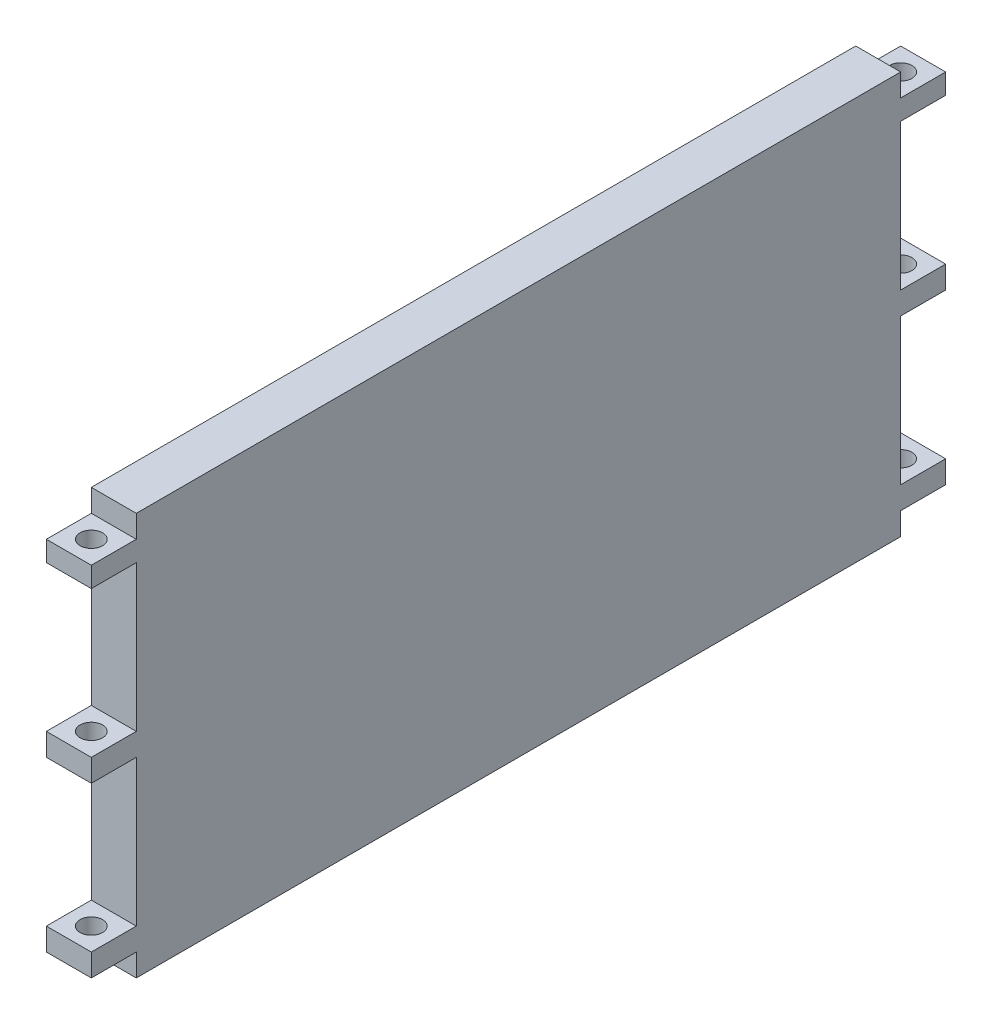
ISO-10303-21;
HEADER;
FILE_DESCRIPTION(('STEP AP214'),'2;1');
FILE_NAME('part.step','',(''),(''),'','','');
FILE_SCHEMA(('AUTOMOTIVE_DESIGN { 1 0 10303 214 1 1 1 1 }'));
ENDSEC;
DATA;
#1=APPLICATION_CONTEXT('core data for automotive mechanical design processes');
#2=APPLICATION_PROTOCOL_DEFINITION('international standard','automotive_design',2000,#1);
#3=PRODUCT_CONTEXT('',#1,'mechanical');
#4=PRODUCT('Part','Part','',(#3));
#5=PRODUCT_RELATED_PRODUCT_CATEGORY('part','',(#4));
#6=PRODUCT_DEFINITION_FORMATION('','',#4);
#7=PRODUCT_DEFINITION_CONTEXT('part definition',#1,'design');
#8=PRODUCT_DEFINITION('design','',#6,#7);
#9=PRODUCT_DEFINITION_SHAPE('','',#8);
#10=(LENGTH_UNIT() NAMED_UNIT(*) SI_UNIT(.MILLI.,.METRE.));
#11=(NAMED_UNIT(*) PLANE_ANGLE_UNIT() SI_UNIT($,.RADIAN.));
#12=(NAMED_UNIT(*) SI_UNIT($,.STERADIAN.) SOLID_ANGLE_UNIT());
#13=UNCERTAINTY_MEASURE_WITH_UNIT(LENGTH_MEASURE(1.E-05),#10,'distance_accuracy_value','');
#14=(GEOMETRIC_REPRESENTATION_CONTEXT(3) GLOBAL_UNCERTAINTY_ASSIGNED_CONTEXT((#13)) GLOBAL_UNIT_ASSIGNED_CONTEXT((#10,
#11,#12)) REPRESENTATION_CONTEXT('',''));
#15=CARTESIAN_POINT('',(0.,0.,0.));
#16=DIRECTION('',(0.,0.,1.));
#17=DIRECTION('',(1.,0.,0.));
#18=AXIS2_PLACEMENT_3D('',#15,#16,#17);
#19=CARTESIAN_POINT('',(20.,89.5,190.));
#20=DIRECTION('',(0.,-1.,0.));
#21=DIRECTION('',(0.,0.,-1.));
#22=AXIS2_PLACEMENT_3D('',#19,#20,#21);
#23=PLANE('',#22);
#24=DIRECTION('',(-1.,0.,0.));
#25=VECTOR('',#24,1.);
#26=CARTESIAN_POINT('',(0.,89.5,-170.));
#27=LINE('',#26,#25);
#28=CARTESIAN_POINT('',(20.,89.5,-170.));
#29=VERTEX_POINT('',#28);
#30=CARTESIAN_POINT('',(0.,89.5,-170.));
#31=VERTEX_POINT('',#30);
#32=EDGE_CURVE('E267',#29,#31,#27,.T.);
#33=ORIENTED_EDGE('',*,*,#32,.T.);
#34=DIRECTION('',(0.,0.,1.));
#35=VECTOR('',#34,1.);
#36=CARTESIAN_POINT('',(0.,89.5,190.));
#37=LINE('',#36,#35);
#38=CARTESIAN_POINT('',(0.,89.5,170.));
#39=VERTEX_POINT('',#38);
#40=EDGE_CURVE('E507',#31,#39,#37,.T.);
#41=ORIENTED_EDGE('',*,*,#40,.T.);
#42=DIRECTION('',(-1.,0.,0.));
#43=VECTOR('',#42,1.);
#44=CARTESIAN_POINT('',(0.,89.5,170.));
#45=LINE('',#44,#43);
#46=CARTESIAN_POINT('',(20.,89.5,170.));
#47=VERTEX_POINT('',#46);
#48=EDGE_CURVE('E420',#47,#39,#45,.T.);
#49=ORIENTED_EDGE('',*,*,#48,.F.);
#50=DIRECTION('',(0.,0.,1.));
#51=VECTOR('',#50,1.);
#52=CARTESIAN_POINT('',(20.,89.5,190.));
#53=LINE('',#52,#51);
#54=EDGE_CURVE('E495',#29,#47,#53,.T.);
#55=ORIENTED_EDGE('',*,*,#54,.F.);
#56=EDGE_LOOP('',(#33,#41,#49,#55));
#57=FACE_BOUND('',#56,.T.);
#58=ADVANCED_FACE('F40',(#57),#23,.F.);
#59=CARTESIAN_POINT('',(20.,89.5,-190.));
#60=DIRECTION('',(0.,0.,1.));
#61=DIRECTION('',(0.,-1.,0.));
#62=AXIS2_PLACEMENT_3D('',#59,#60,#61);
#63=PLANE('',#62);
#64=DIRECTION('',(1.,0.,0.));
#65=VECTOR('',#64,1.);
#66=CARTESIAN_POINT('',(0.,79.5,-190.));
#67=LINE('',#66,#65);
#68=CARTESIAN_POINT('',(0.,79.5,-190.));
#69=VERTEX_POINT('',#68);
#70=CARTESIAN_POINT('',(20.,79.5,-190.));
#71=VERTEX_POINT('',#70);
#72=EDGE_CURVE('E268',#69,#71,#67,.T.);
#73=ORIENTED_EDGE('',*,*,#72,.T.);
#74=DIRECTION('',(0.,1.,0.));
#75=VECTOR('',#74,1.);
#76=CARTESIAN_POINT('',(20.,89.5,-190.));
#77=LINE('',#76,#75);
#78=CARTESIAN_POINT('',(20.,70.5,-190.));
#79=VERTEX_POINT('',#78);
#80=EDGE_CURVE('E489',#79,#71,#77,.T.);
#81=ORIENTED_EDGE('',*,*,#80,.F.);
#82=DIRECTION('',(-1.,0.,0.));
#83=VECTOR('',#82,1.);
#84=CARTESIAN_POINT('',(0.,70.5,-190.));
#85=LINE('',#84,#83);
#86=CARTESIAN_POINT('',(0.,70.5,-190.));
#87=VERTEX_POINT('',#86);
#88=EDGE_CURVE('E286',#79,#87,#85,.T.);
#89=ORIENTED_EDGE('',*,*,#88,.T.);
#90=DIRECTION('',(0.,1.,0.));
#91=VECTOR('',#90,1.);
#92=CARTESIAN_POINT('',(0.,89.5,-190.));
#93=LINE('',#92,#91);
#94=EDGE_CURVE('E479',#87,#69,#93,.T.);
#95=ORIENTED_EDGE('',*,*,#94,.T.);
#96=EDGE_LOOP('',(#73,#81,#89,#95));
#97=FACE_BOUND('',#96,.T.);
#98=ADVANCED_FACE('F42',(#97),#63,.F.);
#99=DIRECTION('',(-1.,0.,0.));
#100=VECTOR('',#99,1.);
#101=CARTESIAN_POINT('',(0.,-79.5,-190.));
#102=LINE('',#101,#100);
#103=CARTESIAN_POINT('',(20.,-79.5,-190.));
#104=VERTEX_POINT('',#103);
#105=CARTESIAN_POINT('',(0.,-79.5,-190.));
#106=VERTEX_POINT('',#105);
#107=EDGE_CURVE('E294',#104,#106,#102,.T.);
#108=ORIENTED_EDGE('',*,*,#107,.T.);
#109=CARTESIAN_POINT('',(0.,-69.5,-190.));
#110=VERTEX_POINT('',#109);
#111=EDGE_CURVE('E506',#106,#110,#93,.T.);
#112=ORIENTED_EDGE('',*,*,#111,.T.);
#113=DIRECTION('',(1.,0.,0.));
#114=VECTOR('',#113,1.);
#115=CARTESIAN_POINT('',(0.,-69.5,-190.));
#116=LINE('',#115,#114);
#117=CARTESIAN_POINT('',(20.,-69.5,-190.));
#118=VERTEX_POINT('',#117);
#119=EDGE_CURVE('E247',#110,#118,#116,.T.);
#120=ORIENTED_EDGE('',*,*,#119,.T.);
#121=EDGE_CURVE('E494',#104,#118,#77,.T.);
#122=ORIENTED_EDGE('',*,*,#121,.F.);
#123=EDGE_LOOP('',(#108,#112,#120,#122));
#124=FACE_BOUND('',#123,.T.);
#125=ADVANCED_FACE('F647',(#124),#63,.F.);
#126=DIRECTION('',(-1.,0.,0.));
#127=VECTOR('',#126,1.);
#128=CARTESIAN_POINT('',(0.,-4.49999999999999,-190.));
#129=LINE('',#128,#127);
#130=CARTESIAN_POINT('',(20.,-4.5,-190.));
#131=VERTEX_POINT('',#130);
#132=CARTESIAN_POINT('',(0.,-4.49999999999999,-190.));
#133=VERTEX_POINT('',#132);
#134=EDGE_CURVE('E602',#131,#133,#129,.T.);
#135=ORIENTED_EDGE('',*,*,#134,.T.);
#136=CARTESIAN_POINT('',(0.,5.5,-190.));
#137=VERTEX_POINT('',#136);
#138=EDGE_CURVE('E253',#133,#137,#93,.T.);
#139=ORIENTED_EDGE('',*,*,#138,.T.);
#140=DIRECTION('',(1.,0.,0.));
#141=VECTOR('',#140,1.);
#142=CARTESIAN_POINT('',(0.,5.5,-190.));
#143=LINE('',#142,#141);
#144=CARTESIAN_POINT('',(20.,5.5,-190.));
#145=VERTEX_POINT('',#144);
#146=EDGE_CURVE('E319',#137,#145,#143,.T.);
#147=ORIENTED_EDGE('',*,*,#146,.T.);
#148=EDGE_CURVE('E493',#131,#145,#77,.T.);
#149=ORIENTED_EDGE('',*,*,#148,.F.);
#150=EDGE_LOOP('',(#135,#139,#147,#149));
#151=FACE_BOUND('',#150,.T.);
#152=ADVANCED_FACE('F601',(#151),#63,.F.);
#153=CARTESIAN_POINT('',(20.,0.,0.));
#154=DIRECTION('',(1.,0.,0.));
#155=DIRECTION('',(0.,0.,-1.));
#156=AXIS2_PLACEMENT_3D('',#153,#154,#155);
#157=PLANE('',#156);
#158=ORIENTED_EDGE('',*,*,#80,.T.);
#159=DIRECTION('',(0.,0.,-1.));
#160=VECTOR('',#159,1.);
#161=CARTESIAN_POINT('',(20.,79.5,-170.));
#162=LINE('',#161,#160);
#163=CARTESIAN_POINT('',(20.,79.5,-170.));
#164=VERTEX_POINT('',#163);
#165=EDGE_CURVE('E279',#164,#71,#162,.T.);
#166=ORIENTED_EDGE('',*,*,#165,.F.);
#167=DIRECTION('',(0.,1.,0.));
#168=VECTOR('',#167,1.);
#169=CARTESIAN_POINT('',(20.,89.5,-170.));
#170=LINE('',#169,#168);
#171=EDGE_CURVE('E272',#164,#29,#170,.T.);
#172=ORIENTED_EDGE('',*,*,#171,.T.);
#173=ORIENTED_EDGE('',*,*,#54,.T.);
#174=DIRECTION('',(0.,1.,0.));
#175=VECTOR('',#174,1.);
#176=CARTESIAN_POINT('',(20.,89.5,170.));
#177=LINE('',#176,#175);
#178=CARTESIAN_POINT('',(20.,79.5,170.));
#179=VERTEX_POINT('',#178);
#180=EDGE_CURVE('E416',#179,#47,#177,.T.);
#181=ORIENTED_EDGE('',*,*,#180,.F.);
#182=DIRECTION('',(0.,0.,1.));
#183=VECTOR('',#182,1.);
#184=CARTESIAN_POINT('',(20.,79.5,170.));
#185=LINE('',#184,#183);
#186=CARTESIAN_POINT('',(20.,79.5,190.));
#187=VERTEX_POINT('',#186);
#188=EDGE_CURVE('E428',#179,#187,#185,.T.);
#189=ORIENTED_EDGE('',*,*,#188,.T.);
#190=DIRECTION('',(0.,-1.,0.));
#191=VECTOR('',#190,1.);
#192=CARTESIAN_POINT('',(20.,89.5,190.));
#193=LINE('',#192,#191);
#194=CARTESIAN_POINT('',(20.,70.5,190.));
#195=VERTEX_POINT('',#194);
#196=EDGE_CURVE('E50',#187,#195,#193,.T.);
#197=ORIENTED_EDGE('',*,*,#196,.T.);
#198=DIRECTION('',(0.,0.,1.));
#199=VECTOR('',#198,1.);
#200=CARTESIAN_POINT('',(20.,70.5,170.));
#201=LINE('',#200,#199);
#202=CARTESIAN_POINT('',(20.,70.5,170.));
#203=VERTEX_POINT('',#202);
#204=EDGE_CURVE('E480',#203,#195,#201,.T.);
#205=ORIENTED_EDGE('',*,*,#204,.F.);
#206=DIRECTION('',(0.,1.,0.));
#207=VECTOR('',#206,1.);
#208=CARTESIAN_POINT('',(20.,70.5,170.));
#209=LINE('',#208,#207);
#210=CARTESIAN_POINT('',(20.,5.5,170.));
#211=VERTEX_POINT('',#210);
#212=EDGE_CURVE('E464',#211,#203,#209,.T.);
#213=ORIENTED_EDGE('',*,*,#212,.F.);
#214=DIRECTION('',(0.,0.,1.));
#215=VECTOR('',#214,1.);
#216=CARTESIAN_POINT('',(20.,5.5,170.));
#217=LINE('',#216,#215);
#218=CARTESIAN_POINT('',(20.,5.5,190.));
#219=VERTEX_POINT('',#218);
#220=EDGE_CURVE('E483',#211,#219,#217,.T.);
#221=ORIENTED_EDGE('',*,*,#220,.T.);
#222=CARTESIAN_POINT('',(20.,-4.5,190.));
#223=VERTEX_POINT('',#222);
#224=EDGE_CURVE('E501',#219,#223,#193,.T.);
#225=ORIENTED_EDGE('',*,*,#224,.T.);
#226=DIRECTION('',(0.,0.,1.));
#227=VECTOR('',#226,1.);
#228=CARTESIAN_POINT('',(20.,-4.5,170.));
#229=LINE('',#228,#227);
#230=CARTESIAN_POINT('',(20.,-4.5,170.));
#231=VERTEX_POINT('',#230);
#232=EDGE_CURVE('E398',#231,#223,#229,.T.);
#233=ORIENTED_EDGE('',*,*,#232,.F.);
#234=DIRECTION('',(0.,1.,0.));
#235=VECTOR('',#234,1.);
#236=CARTESIAN_POINT('',(20.,-4.5,170.));
#237=LINE('',#236,#235);
#238=CARTESIAN_POINT('',(20.,-69.5,170.));
#239=VERTEX_POINT('',#238);
#240=EDGE_CURVE('E382',#239,#231,#237,.T.);
#241=ORIENTED_EDGE('',*,*,#240,.F.);
#242=DIRECTION('',(0.,0.,1.));
#243=VECTOR('',#242,1.);
#244=CARTESIAN_POINT('',(20.,-69.5,170.));
#245=LINE('',#244,#243);
#246=CARTESIAN_POINT('',(20.,-69.5,190.));
#247=VERTEX_POINT('',#246);
#248=EDGE_CURVE('E401',#239,#247,#245,.T.);
#249=ORIENTED_EDGE('',*,*,#248,.T.);
#250=CARTESIAN_POINT('',(20.,-79.5,190.));
#251=VERTEX_POINT('',#250);
#252=EDGE_CURVE('E498',#247,#251,#193,.T.);
#253=ORIENTED_EDGE('',*,*,#252,.T.);
#254=DIRECTION('',(0.,0.,1.));
#255=VECTOR('',#254,1.);
#256=CARTESIAN_POINT('',(20.,-79.5,170.));
#257=LINE('',#256,#255);
#258=CARTESIAN_POINT('',(20.,-79.5,170.));
#259=VERTEX_POINT('',#258);
#260=EDGE_CURVE('E447',#259,#251,#257,.T.);
#261=ORIENTED_EDGE('',*,*,#260,.F.);
#262=DIRECTION('',(0.,1.,0.));
#263=VECTOR('',#262,1.);
#264=CARTESIAN_POINT('',(20.,-89.5,170.));
#265=LINE('',#264,#263);
#266=CARTESIAN_POINT('',(20.,-89.5,170.));
#267=VERTEX_POINT('',#266);
#268=EDGE_CURVE('E441',#267,#259,#265,.T.);
#269=ORIENTED_EDGE('',*,*,#268,.F.);
#270=DIRECTION('',(0.,0.,-1.));
#271=VECTOR('',#270,1.);
#272=CARTESIAN_POINT('',(20.,-89.5,190.));
#273=LINE('',#272,#271);
#274=CARTESIAN_POINT('',(20.,-89.5,-170.));
#275=VERTEX_POINT('',#274);
#276=EDGE_CURVE('E11',#267,#275,#273,.T.);
#277=ORIENTED_EDGE('',*,*,#276,.T.);
#278=DIRECTION('',(0.,1.,0.));
#279=VECTOR('',#278,1.);
#280=CARTESIAN_POINT('',(20.,-89.5,-170.));
#281=LINE('',#280,#279);
#282=CARTESIAN_POINT('',(20.,-79.5,-170.));
#283=VERTEX_POINT('',#282);
#284=EDGE_CURVE('E297',#275,#283,#281,.T.);
#285=ORIENTED_EDGE('',*,*,#284,.T.);
#286=DIRECTION('',(0.,0.,-1.));
#287=VECTOR('',#286,1.);
#288=CARTESIAN_POINT('',(20.,-79.5,-170.));
#289=LINE('',#288,#287);
#290=EDGE_CURVE('E283',#283,#104,#289,.T.);
#291=ORIENTED_EDGE('',*,*,#290,.T.);
#292=ORIENTED_EDGE('',*,*,#121,.T.);
#293=DIRECTION('',(0.,0.,-1.));
#294=VECTOR('',#293,1.);
#295=CARTESIAN_POINT('',(20.,-69.5,-170.));
#296=LINE('',#295,#294);
#297=CARTESIAN_POINT('',(20.,-69.5,-170.));
#298=VERTEX_POINT('',#297);
#299=EDGE_CURVE('E258',#298,#118,#296,.T.);
#300=ORIENTED_EDGE('',*,*,#299,.F.);
#301=DIRECTION('',(0.,1.,0.));
#302=VECTOR('',#301,1.);
#303=CARTESIAN_POINT('',(20.,-4.5,-170.));
#304=LINE('',#303,#302);
#305=CARTESIAN_POINT('',(20.,-4.5,-170.));
#306=VERTEX_POINT('',#305);
#307=EDGE_CURVE('E239',#298,#306,#304,.T.);
#308=ORIENTED_EDGE('',*,*,#307,.T.);
#309=DIRECTION('',(0.,0.,-1.));
#310=VECTOR('',#309,1.);
#311=CARTESIAN_POINT('',(20.,-4.5,-170.));
#312=LINE('',#311,#310);
#313=EDGE_CURVE('E234',#306,#131,#312,.T.);
#314=ORIENTED_EDGE('',*,*,#313,.T.);
#315=ORIENTED_EDGE('',*,*,#148,.T.);
#316=DIRECTION('',(0.,0.,-1.));
#317=VECTOR('',#316,1.);
#318=CARTESIAN_POINT('',(20.,5.5,-170.));
#319=LINE('',#318,#317);
#320=CARTESIAN_POINT('',(20.,5.5,-170.));
#321=VERTEX_POINT('',#320);
#322=EDGE_CURVE('E340',#321,#145,#319,.T.);
#323=ORIENTED_EDGE('',*,*,#322,.F.);
#324=DIRECTION('',(0.,1.,0.));
#325=VECTOR('',#324,1.);
#326=CARTESIAN_POINT('',(20.,70.5,-170.));
#327=LINE('',#326,#325);
#328=CARTESIAN_POINT('',(20.,70.5,-170.));
#329=VERTEX_POINT('',#328);
#330=EDGE_CURVE('E322',#321,#329,#327,.T.);
#331=ORIENTED_EDGE('',*,*,#330,.T.);
#332=DIRECTION('',(0.,0.,-1.));
#333=VECTOR('',#332,1.);
#334=CARTESIAN_POINT('',(20.,70.5,-170.));
#335=LINE('',#334,#333);
#336=EDGE_CURVE('E343',#329,#79,#335,.T.);
#337=ORIENTED_EDGE('',*,*,#336,.T.);
#338=EDGE_LOOP('',(#158,#166,#172,#173,#181,#189,#197,#205,#213,#221,#225,#233,#241,#249,#253,
#261,#269,#277,#285,#291,#292,#300,#308,#314,#315,#323,#331,#337));
#339=FACE_BOUND('',#338,.T.);
#340=ADVANCED_FACE('F541',(#339),#157,.T.);
#341=CARTESIAN_POINT('',(0.,0.,0.));
#342=DIRECTION('',(1.,0.,0.));
#343=DIRECTION('',(0.,0.,-1.));
#344=AXIS2_PLACEMENT_3D('',#341,#342,#343);
#345=PLANE('',#344);
#346=DIRECTION('',(0.,0.,-1.));
#347=VECTOR('',#346,1.);
#348=CARTESIAN_POINT('',(0.,79.5,-170.));
#349=LINE('',#348,#347);
#350=CARTESIAN_POINT('',(0.,79.5,-170.));
#351=VERTEX_POINT('',#350);
#352=EDGE_CURVE('E58',#351,#69,#349,.T.);
#353=ORIENTED_EDGE('',*,*,#352,.T.);
#354=ORIENTED_EDGE('',*,*,#94,.F.);
#355=DIRECTION('',(0.,0.,-1.));
#356=VECTOR('',#355,1.);
#357=CARTESIAN_POINT('',(0.,70.5,-170.));
#358=LINE('',#357,#356);
#359=CARTESIAN_POINT('',(0.,70.5,-170.));
#360=VERTEX_POINT('',#359);
#361=EDGE_CURVE('E329',#360,#87,#358,.T.);
#362=ORIENTED_EDGE('',*,*,#361,.F.);
#363=DIRECTION('',(0.,-1.,0.));
#364=VECTOR('',#363,1.);
#365=CARTESIAN_POINT('',(0.,70.5,-170.));
#366=LINE('',#365,#364);
#367=CARTESIAN_POINT('',(0.,5.5,-170.));
#368=VERTEX_POINT('',#367);
#369=EDGE_CURVE('E314',#360,#368,#366,.T.);
#370=ORIENTED_EDGE('',*,*,#369,.T.);
#371=DIRECTION('',(0.,0.,-1.));
#372=VECTOR('',#371,1.);
#373=CARTESIAN_POINT('',(0.,5.5,-170.));
#374=LINE('',#373,#372);
#375=EDGE_CURVE('E336',#368,#137,#374,.T.);
#376=ORIENTED_EDGE('',*,*,#375,.T.);
#377=ORIENTED_EDGE('',*,*,#138,.F.);
#378=DIRECTION('',(0.,0.,-1.));
#379=VECTOR('',#378,1.);
#380=CARTESIAN_POINT('',(0.,-4.49999999999999,-170.));
#381=LINE('',#380,#379);
#382=CARTESIAN_POINT('',(0.,-4.49999999999999,-170.));
#383=VERTEX_POINT('',#382);
#384=EDGE_CURVE('E231',#383,#133,#381,.T.);
#385=ORIENTED_EDGE('',*,*,#384,.F.);
#386=DIRECTION('',(0.,-1.,0.));
#387=VECTOR('',#386,1.);
#388=CARTESIAN_POINT('',(0.,-4.49999999999999,-170.));
#389=LINE('',#388,#387);
#390=CARTESIAN_POINT('',(0.,-69.5,-170.));
#391=VERTEX_POINT('',#390);
#392=EDGE_CURVE('E240',#383,#391,#389,.T.);
#393=ORIENTED_EDGE('',*,*,#392,.T.);
#394=DIRECTION('',(0.,0.,-1.));
#395=VECTOR('',#394,1.);
#396=CARTESIAN_POINT('',(0.,-69.5,-170.));
#397=LINE('',#396,#395);
#398=EDGE_CURVE('E66',#391,#110,#397,.T.);
#399=ORIENTED_EDGE('',*,*,#398,.T.);
#400=ORIENTED_EDGE('',*,*,#111,.F.);
#401=DIRECTION('',(0.,0.,-1.));
#402=VECTOR('',#401,1.);
#403=CARTESIAN_POINT('',(0.,-79.5,-170.));
#404=LINE('',#403,#402);
#405=CARTESIAN_POINT('',(0.,-79.5,-170.));
#406=VERTEX_POINT('',#405);
#407=EDGE_CURVE('E305',#406,#106,#404,.T.);
#408=ORIENTED_EDGE('',*,*,#407,.F.);
#409=DIRECTION('',(0.,-1.,0.));
#410=VECTOR('',#409,1.);
#411=CARTESIAN_POINT('',(0.,-89.5,-170.));
#412=LINE('',#411,#410);
#413=CARTESIAN_POINT('',(0.,-89.5,-170.));
#414=VERTEX_POINT('',#413);
#415=EDGE_CURVE('E289',#406,#414,#412,.T.);
#416=ORIENTED_EDGE('',*,*,#415,.T.);
#417=DIRECTION('',(0.,0.,-1.));
#418=VECTOR('',#417,1.);
#419=CARTESIAN_POINT('',(0.,-89.5,190.));
#420=LINE('',#419,#418);
#421=CARTESIAN_POINT('',(0.,-89.5,170.));
#422=VERTEX_POINT('',#421);
#423=EDGE_CURVE('E44',#422,#414,#420,.T.);
#424=ORIENTED_EDGE('',*,*,#423,.F.);
#425=DIRECTION('',(0.,-1.,0.));
#426=VECTOR('',#425,1.);
#427=CARTESIAN_POINT('',(0.,-89.5,170.));
#428=LINE('',#427,#426);
#429=CARTESIAN_POINT('',(0.,-79.5,170.));
#430=VERTEX_POINT('',#429);
#431=EDGE_CURVE('E435',#430,#422,#428,.T.);
#432=ORIENTED_EDGE('',*,*,#431,.F.);
#433=DIRECTION('',(0.,0.,1.));
#434=VECTOR('',#433,1.);
#435=CARTESIAN_POINT('',(0.,-79.5,170.));
#436=LINE('',#435,#434);
#437=CARTESIAN_POINT('',(0.,-79.5,190.));
#438=VERTEX_POINT('',#437);
#439=EDGE_CURVE('E427',#430,#438,#436,.T.);
#440=ORIENTED_EDGE('',*,*,#439,.T.);
#441=DIRECTION('',(0.,-1.,0.));
#442=VECTOR('',#441,1.);
#443=CARTESIAN_POINT('',(0.,89.5,190.));
#444=LINE('',#443,#442);
#445=CARTESIAN_POINT('',(0.,-69.5,190.));
#446=VERTEX_POINT('',#445);
#447=EDGE_CURVE('E509',#446,#438,#444,.T.);
#448=ORIENTED_EDGE('',*,*,#447,.F.);
#449=DIRECTION('',(0.,0.,1.));
#450=VECTOR('',#449,1.);
#451=CARTESIAN_POINT('',(0.,-69.5,170.));
#452=LINE('',#451,#450);
#453=CARTESIAN_POINT('',(0.,-69.5,170.));
#454=VERTEX_POINT('',#453);
#455=EDGE_CURVE('E388',#454,#446,#452,.T.);
#456=ORIENTED_EDGE('',*,*,#455,.F.);
#457=DIRECTION('',(0.,-1.,0.));
#458=VECTOR('',#457,1.);
#459=CARTESIAN_POINT('',(0.,-4.49999999999999,170.));
#460=LINE('',#459,#458);
#461=CARTESIAN_POINT('',(0.,-4.49999999999999,170.));
#462=VERTEX_POINT('',#461);
#463=EDGE_CURVE('E373',#462,#454,#460,.T.);
#464=ORIENTED_EDGE('',*,*,#463,.F.);
#465=DIRECTION('',(0.,0.,1.));
#466=VECTOR('',#465,1.);
#467=CARTESIAN_POINT('',(0.,-4.49999999999999,170.));
#468=LINE('',#467,#466);
#469=CARTESIAN_POINT('',(0.,-4.49999999999999,190.));
#470=VERTEX_POINT('',#469);
#471=EDGE_CURVE('E393',#462,#470,#468,.T.);
#472=ORIENTED_EDGE('',*,*,#471,.T.);
#473=CARTESIAN_POINT('',(0.,5.5,190.));
#474=VERTEX_POINT('',#473);
#475=EDGE_CURVE('E512',#474,#470,#444,.T.);
#476=ORIENTED_EDGE('',*,*,#475,.F.);
#477=DIRECTION('',(0.,0.,1.));
#478=VECTOR('',#477,1.);
#479=CARTESIAN_POINT('',(0.,5.5,170.));
#480=LINE('',#479,#478);
#481=CARTESIAN_POINT('',(0.,5.5,170.));
#482=VERTEX_POINT('',#481);
#483=EDGE_CURVE('E470',#482,#474,#480,.T.);
#484=ORIENTED_EDGE('',*,*,#483,.F.);
#485=DIRECTION('',(0.,-1.,0.));
#486=VECTOR('',#485,1.);
#487=CARTESIAN_POINT('',(0.,70.5,170.));
#488=LINE('',#487,#486);
#489=CARTESIAN_POINT('',(0.,70.5,170.));
#490=VERTEX_POINT('',#489);
#491=EDGE_CURVE('E455',#490,#482,#488,.T.);
#492=ORIENTED_EDGE('',*,*,#491,.F.);
#493=DIRECTION('',(0.,0.,1.));
#494=VECTOR('',#493,1.);
#495=CARTESIAN_POINT('',(0.,70.5,170.));
#496=LINE('',#495,#494);
#497=CARTESIAN_POINT('',(0.,70.5,190.));
#498=VERTEX_POINT('',#497);
#499=EDGE_CURVE('E475',#490,#498,#496,.T.);
#500=ORIENTED_EDGE('',*,*,#499,.T.);
#501=CARTESIAN_POINT('',(0.,79.5,190.));
#502=VERTEX_POINT('',#501);
#503=EDGE_CURVE('E513',#502,#498,#444,.T.);
#504=ORIENTED_EDGE('',*,*,#503,.F.);
#505=DIRECTION('',(0.,0.,1.));
#506=VECTOR('',#505,1.);
#507=CARTESIAN_POINT('',(0.,79.5,170.));
#508=LINE('',#507,#506);
#509=CARTESIAN_POINT('',(0.,79.5,170.));
#510=VERTEX_POINT('',#509);
#511=EDGE_CURVE('E424',#510,#502,#508,.T.);
#512=ORIENTED_EDGE('',*,*,#511,.F.);
#513=DIRECTION('',(0.,-1.,0.));
#514=VECTOR('',#513,1.);
#515=CARTESIAN_POINT('',(0.,89.5,170.));
#516=LINE('',#515,#514);
#517=EDGE_CURVE('E407',#39,#510,#516,.T.);
#518=ORIENTED_EDGE('',*,*,#517,.F.);
#519=ORIENTED_EDGE('',*,*,#40,.F.);
#520=DIRECTION('',(0.,-1.,0.));
#521=VECTOR('',#520,1.);
#522=CARTESIAN_POINT('',(0.,89.5,-170.));
#523=LINE('',#522,#521);
#524=EDGE_CURVE('E263',#31,#351,#523,.T.);
#525=ORIENTED_EDGE('',*,*,#524,.T.);
#526=EDGE_LOOP('',(#353,#354,#362,#370,#376,#377,#385,#393,#399,#400,#408,#416,#424,#432,#440,
#448,#456,#464,#472,#476,#484,#492,#500,#504,#512,#518,#519,#525));
#527=FACE_BOUND('',#526,.T.);
#528=ADVANCED_FACE('F250',(#527),#345,.F.);
#529=CARTESIAN_POINT('',(20.,89.5,190.));
#530=DIRECTION('',(0.,0.,-1.));
#531=DIRECTION('',(0.,1.,0.));
#532=AXIS2_PLACEMENT_3D('',#529,#530,#531);
#533=PLANE('',#532);
#534=ORIENTED_EDGE('',*,*,#475,.T.);
#535=DIRECTION('',(-1.,0.,0.));
#536=VECTOR('',#535,1.);
#537=CARTESIAN_POINT('',(0.,-4.49999999999999,190.));
#538=LINE('',#537,#536);
#539=EDGE_CURVE('E378',#223,#470,#538,.T.);
#540=ORIENTED_EDGE('',*,*,#539,.F.);
#541=ORIENTED_EDGE('',*,*,#224,.F.);
#542=DIRECTION('',(1.,0.,0.));
#543=VECTOR('',#542,1.);
#544=CARTESIAN_POINT('',(0.,5.5,190.));
#545=LINE('',#544,#543);
#546=EDGE_CURVE('E432',#474,#219,#545,.T.);
#547=ORIENTED_EDGE('',*,*,#546,.F.);
#548=EDGE_LOOP('',(#534,#540,#541,#547));
#549=FACE_BOUND('',#548,.T.);
#550=ADVANCED_FACE('F571',(#549),#533,.F.);
#551=ORIENTED_EDGE('',*,*,#196,.F.);
#552=DIRECTION('',(1.,0.,0.));
#553=VECTOR('',#552,1.);
#554=CARTESIAN_POINT('',(0.,79.5,190.));
#555=LINE('',#554,#553);
#556=EDGE_CURVE('E412',#502,#187,#555,.T.);
#557=ORIENTED_EDGE('',*,*,#556,.F.);
#558=ORIENTED_EDGE('',*,*,#503,.T.);
#559=DIRECTION('',(-1.,0.,0.));
#560=VECTOR('',#559,1.);
#561=CARTESIAN_POINT('',(0.,70.5,190.));
#562=LINE('',#561,#560);
#563=EDGE_CURVE('E460',#195,#498,#562,.T.);
#564=ORIENTED_EDGE('',*,*,#563,.F.);
#565=EDGE_LOOP('',(#551,#557,#558,#564));
#566=FACE_BOUND('',#565,.T.);
#567=ADVANCED_FACE('F592',(#566),#533,.F.);
#568=ORIENTED_EDGE('',*,*,#447,.T.);
#569=DIRECTION('',(-1.,0.,0.));
#570=VECTOR('',#569,1.);
#571=CARTESIAN_POINT('',(0.,-79.5,190.));
#572=LINE('',#571,#570);
#573=EDGE_CURVE('E397',#251,#438,#572,.T.);
#574=ORIENTED_EDGE('',*,*,#573,.F.);
#575=ORIENTED_EDGE('',*,*,#252,.F.);
#576=DIRECTION('',(1.,0.,0.));
#577=VECTOR('',#576,1.);
#578=CARTESIAN_POINT('',(0.,-69.5,190.));
#579=LINE('',#578,#577);
#580=EDGE_CURVE('E372',#446,#247,#579,.T.);
#581=ORIENTED_EDGE('',*,*,#580,.F.);
#582=EDGE_LOOP('',(#568,#574,#575,#581));
#583=FACE_BOUND('',#582,.T.);
#584=ADVANCED_FACE('F557',(#583),#533,.F.);
#585=CARTESIAN_POINT('',(20.,-89.5,190.));
#586=DIRECTION('',(0.,1.,0.));
#587=DIRECTION('',(0.,0.,1.));
#588=AXIS2_PLACEMENT_3D('',#585,#586,#587);
#589=PLANE('',#588);
#590=ORIENTED_EDGE('',*,*,#423,.T.);
#591=DIRECTION('',(1.,0.,0.));
#592=VECTOR('',#591,1.);
#593=CARTESIAN_POINT('',(0.,-89.5,-170.));
#594=LINE('',#593,#592);
#595=EDGE_CURVE('E301',#414,#275,#594,.T.);
#596=ORIENTED_EDGE('',*,*,#595,.T.);
#597=ORIENTED_EDGE('',*,*,#276,.F.);
#598=DIRECTION('',(1.,0.,0.));
#599=VECTOR('',#598,1.);
#600=CARTESIAN_POINT('',(0.,-89.5,170.));
#601=LINE('',#600,#599);
#602=EDGE_CURVE('E438',#422,#267,#601,.T.);
#603=ORIENTED_EDGE('',*,*,#602,.F.);
#604=EDGE_LOOP('',(#590,#596,#597,#603));
#605=FACE_BOUND('',#604,.T.);
#606=ADVANCED_FACE('F531',(#605),#589,.F.);
#607=CARTESIAN_POINT('',(0.,70.5,170.));
#608=DIRECTION('',(0.,1.,0.));
#609=DIRECTION('',(0.,0.,1.));
#610=AXIS2_PLACEMENT_3D('',#607,#608,#609);
#611=PLANE('',#610);
#612=CARTESIAN_POINT('',(10.,70.5,180.));
#613=DIRECTION('',(0.,1.,0.));
#614=DIRECTION('',(0.,0.,1.));
#615=AXIS2_PLACEMENT_3D('',#612,#613,#614);
#616=CIRCLE('',#615,5.);
#617=CARTESIAN_POINT('',(10.,70.5,185.));
#618=VERTEX_POINT('',#617);
#619=EDGE_CURVE('E368',#618,#618,#616,.T.);
#620=ORIENTED_EDGE('',*,*,#619,.T.);
#621=EDGE_LOOP('',(#620));
#622=FACE_BOUND('',#621,.T.);
#623=ORIENTED_EDGE('',*,*,#563,.T.);
#624=ORIENTED_EDGE('',*,*,#499,.F.);
#625=DIRECTION('',(-1.,0.,0.));
#626=VECTOR('',#625,1.);
#627=CARTESIAN_POINT('',(0.,70.5,170.));
#628=LINE('',#627,#626);
#629=EDGE_CURVE('E467',#203,#490,#628,.T.);
#630=ORIENTED_EDGE('',*,*,#629,.F.);
#631=ORIENTED_EDGE('',*,*,#204,.T.);
#632=EDGE_LOOP('',(#623,#624,#630,#631));
#633=FACE_BOUND('',#632,.T.);
#634=ADVANCED_FACE('F584',(#622,#633),#611,.F.);
#635=CARTESIAN_POINT('',(0.,5.5,170.));
#636=DIRECTION('',(0.,-1.,0.));
#637=DIRECTION('',(0.,0.,-1.));
#638=AXIS2_PLACEMENT_3D('',#635,#636,#637);
#639=PLANE('',#638);
#640=CARTESIAN_POINT('',(10.,5.50000000000001,180.));
#641=DIRECTION('',(0.,-1.,0.));
#642=DIRECTION('',(0.,0.,-1.));
#643=AXIS2_PLACEMENT_3D('',#640,#641,#642);
#644=CIRCLE('',#643,5.);
#645=CARTESIAN_POINT('',(10.,5.50000000000001,175.));
#646=VERTEX_POINT('',#645);
#647=EDGE_CURVE('E364',#646,#646,#644,.T.);
#648=ORIENTED_EDGE('',*,*,#647,.T.);
#649=EDGE_LOOP('',(#648));
#650=FACE_BOUND('',#649,.T.);
#651=ORIENTED_EDGE('',*,*,#546,.T.);
#652=ORIENTED_EDGE('',*,*,#220,.F.);
#653=DIRECTION('',(1.,0.,0.));
#654=VECTOR('',#653,1.);
#655=CARTESIAN_POINT('',(0.,5.5,170.));
#656=LINE('',#655,#654);
#657=EDGE_CURVE('E459',#482,#211,#656,.T.);
#658=ORIENTED_EDGE('',*,*,#657,.F.);
#659=ORIENTED_EDGE('',*,*,#483,.T.);
#660=EDGE_LOOP('',(#651,#652,#658,#659));
#661=FACE_BOUND('',#660,.T.);
#662=ADVANCED_FACE('F575',(#650,#661),#639,.F.);
#663=CARTESIAN_POINT('',(0.,0.,170.));
#664=DIRECTION('',(0.,0.,1.));
#665=DIRECTION('',(1.,0.,0.));
#666=AXIS2_PLACEMENT_3D('',#663,#664,#665);
#667=PLANE('',#666);
#668=ORIENTED_EDGE('',*,*,#491,.T.);
#669=ORIENTED_EDGE('',*,*,#657,.T.);
#670=ORIENTED_EDGE('',*,*,#212,.T.);
#671=ORIENTED_EDGE('',*,*,#629,.T.);
#672=EDGE_LOOP('',(#668,#669,#670,#671));
#673=FACE_BOUND('',#672,.T.);
#674=ADVANCED_FACE('F581',(#673),#667,.T.);
#675=CARTESIAN_POINT('',(0.,-4.49999999999999,170.));
#676=DIRECTION('',(0.,1.,0.));
#677=DIRECTION('',(-1.,0.,0.));
#678=AXIS2_PLACEMENT_3D('',#675,#676,#677);
#679=PLANE('',#678);
#680=CARTESIAN_POINT('',(10.,-4.49999999999999,180.));
#681=DIRECTION('',(0.,1.,0.));
#682=DIRECTION('',(-1.,0.,0.));
#683=AXIS2_PLACEMENT_3D('',#680,#681,#682);
#684=CIRCLE('',#683,5.);
#685=CARTESIAN_POINT('',(5.,-4.49999999999999,180.));
#686=VERTEX_POINT('',#685);
#687=EDGE_CURVE('E360',#686,#686,#684,.T.);
#688=ORIENTED_EDGE('',*,*,#687,.T.);
#689=EDGE_LOOP('',(#688));
#690=FACE_BOUND('',#689,.T.);
#691=ORIENTED_EDGE('',*,*,#539,.T.);
#692=ORIENTED_EDGE('',*,*,#471,.F.);
#693=DIRECTION('',(-1.,0.,0.));
#694=VECTOR('',#693,1.);
#695=CARTESIAN_POINT('',(0.,-4.49999999999999,170.));
#696=LINE('',#695,#694);
#697=EDGE_CURVE('E385',#231,#462,#696,.T.);
#698=ORIENTED_EDGE('',*,*,#697,.F.);
#699=ORIENTED_EDGE('',*,*,#232,.T.);
#700=EDGE_LOOP('',(#691,#692,#698,#699));
#701=FACE_BOUND('',#700,.T.);
#702=ADVANCED_FACE('F565',(#690,#701),#679,.F.);
#703=CARTESIAN_POINT('',(0.,-69.5,170.));
#704=DIRECTION('',(0.,-1.,0.));
#705=DIRECTION('',(0.,0.,-1.));
#706=AXIS2_PLACEMENT_3D('',#703,#704,#705);
#707=PLANE('',#706);
#708=CARTESIAN_POINT('',(10.,-69.5,180.));
#709=DIRECTION('',(0.,-1.,0.));
#710=DIRECTION('',(0.,0.,-1.));
#711=AXIS2_PLACEMENT_3D('',#708,#709,#710);
#712=CIRCLE('',#711,5.);
#713=CARTESIAN_POINT('',(10.,-69.5,175.));
#714=VERTEX_POINT('',#713);
#715=EDGE_CURVE('E356',#714,#714,#712,.T.);
#716=ORIENTED_EDGE('',*,*,#715,.T.);
#717=EDGE_LOOP('',(#716));
#718=FACE_BOUND('',#717,.T.);
#719=ORIENTED_EDGE('',*,*,#580,.T.);
#720=ORIENTED_EDGE('',*,*,#248,.F.);
#721=DIRECTION('',(1.,0.,0.));
#722=VECTOR('',#721,1.);
#723=CARTESIAN_POINT('',(0.,-69.5,170.));
#724=LINE('',#723,#722);
#725=EDGE_CURVE('E377',#454,#239,#724,.T.);
#726=ORIENTED_EDGE('',*,*,#725,.F.);
#727=ORIENTED_EDGE('',*,*,#455,.T.);
#728=EDGE_LOOP('',(#719,#720,#726,#727));
#729=FACE_BOUND('',#728,.T.);
#730=ADVANCED_FACE('F555',(#718,#729),#707,.F.);
#731=CARTESIAN_POINT('',(0.,0.,170.));
#732=DIRECTION('',(0.,0.,1.));
#733=DIRECTION('',(1.,0.,0.));
#734=AXIS2_PLACEMENT_3D('',#731,#732,#733);
#735=PLANE('',#734);
#736=ORIENTED_EDGE('',*,*,#463,.T.);
#737=ORIENTED_EDGE('',*,*,#725,.T.);
#738=ORIENTED_EDGE('',*,*,#240,.T.);
#739=ORIENTED_EDGE('',*,*,#697,.T.);
#740=EDGE_LOOP('',(#736,#737,#738,#739));
#741=FACE_BOUND('',#740,.T.);
#742=ADVANCED_FACE('F561',(#741),#735,.T.);
#743=CARTESIAN_POINT('',(0.,-79.5,170.));
#744=DIRECTION('',(0.,1.,0.));
#745=DIRECTION('',(0.,0.,1.));
#746=AXIS2_PLACEMENT_3D('',#743,#744,#745);
#747=PLANE('',#746);
#748=CARTESIAN_POINT('',(10.,-79.5,180.));
#749=DIRECTION('',(0.,1.,0.));
#750=DIRECTION('',(0.,0.,1.));
#751=AXIS2_PLACEMENT_3D('',#748,#749,#750);
#752=CIRCLE('',#751,5.);
#753=CARTESIAN_POINT('',(10.,-79.5,185.));
#754=VERTEX_POINT('',#753);
#755=EDGE_CURVE('E352',#754,#754,#752,.F.);
#756=ORIENTED_EDGE('',*,*,#755,.F.);
#757=EDGE_LOOP('',(#756));
#758=FACE_BOUND('',#757,.T.);
#759=ORIENTED_EDGE('',*,*,#573,.T.);
#760=ORIENTED_EDGE('',*,*,#439,.F.);
#761=DIRECTION('',(-1.,0.,0.));
#762=VECTOR('',#761,1.);
#763=CARTESIAN_POINT('',(0.,-79.5,170.));
#764=LINE('',#763,#762);
#765=EDGE_CURVE('E444',#259,#430,#764,.T.);
#766=ORIENTED_EDGE('',*,*,#765,.F.);
#767=ORIENTED_EDGE('',*,*,#260,.T.);
#768=EDGE_LOOP('',(#759,#760,#766,#767));
#769=FACE_BOUND('',#768,.T.);
#770=ADVANCED_FACE('F551',(#758,#769),#747,.F.);
#771=CARTESIAN_POINT('',(0.,0.,170.));
#772=DIRECTION('',(0.,0.,-1.));
#773=DIRECTION('',(-1.,0.,0.));
#774=AXIS2_PLACEMENT_3D('',#771,#772,#773);
#775=PLANE('',#774);
#776=ORIENTED_EDGE('',*,*,#431,.T.);
#777=ORIENTED_EDGE('',*,*,#602,.T.);
#778=ORIENTED_EDGE('',*,*,#268,.T.);
#779=ORIENTED_EDGE('',*,*,#765,.T.);
#780=EDGE_LOOP('',(#776,#777,#778,#779));
#781=FACE_BOUND('',#780,.T.);
#782=ADVANCED_FACE('F548',(#781),#775,.F.);
#783=CARTESIAN_POINT('',(0.,79.5,170.));
#784=DIRECTION('',(0.,-1.,0.));
#785=DIRECTION('',(0.,0.,-1.));
#786=AXIS2_PLACEMENT_3D('',#783,#784,#785);
#787=PLANE('',#786);
#788=CARTESIAN_POINT('',(10.,79.5,180.));
#789=DIRECTION('',(0.,1.,0.));
#790=DIRECTION('',(0.,0.,1.));
#791=AXIS2_PLACEMENT_3D('',#788,#789,#790);
#792=CIRCLE('',#791,5.);
#793=CARTESIAN_POINT('',(10.,79.5,185.));
#794=VERTEX_POINT('',#793);
#795=EDGE_CURVE('E339',#794,#794,#792,.T.);
#796=ORIENTED_EDGE('',*,*,#795,.F.);
#797=EDGE_LOOP('',(#796));
#798=FACE_BOUND('',#797,.T.);
#799=ORIENTED_EDGE('',*,*,#556,.T.);
#800=ORIENTED_EDGE('',*,*,#188,.F.);
#801=DIRECTION('',(1.,0.,0.));
#802=VECTOR('',#801,1.);
#803=CARTESIAN_POINT('',(0.,79.5,170.));
#804=LINE('',#803,#802);
#805=EDGE_CURVE('E411',#510,#179,#804,.T.);
#806=ORIENTED_EDGE('',*,*,#805,.F.);
#807=ORIENTED_EDGE('',*,*,#511,.T.);
#808=EDGE_LOOP('',(#799,#800,#806,#807));
#809=FACE_BOUND('',#808,.T.);
#810=ADVANCED_FACE('F590',(#798,#809),#787,.F.);
#811=CARTESIAN_POINT('',(0.,0.,170.));
#812=DIRECTION('',(0.,0.,1.));
#813=DIRECTION('',(1.,0.,0.));
#814=AXIS2_PLACEMENT_3D('',#811,#812,#813);
#815=PLANE('',#814);
#816=ORIENTED_EDGE('',*,*,#517,.T.);
#817=ORIENTED_EDGE('',*,*,#805,.T.);
#818=ORIENTED_EDGE('',*,*,#180,.T.);
#819=ORIENTED_EDGE('',*,*,#48,.T.);
#820=EDGE_LOOP('',(#816,#817,#818,#819));
#821=FACE_BOUND('',#820,.T.);
#822=ADVANCED_FACE('F626',(#821),#815,.T.);
#823=CARTESIAN_POINT('',(10.,-93.6421356237309,180.));
#824=DIRECTION('',(0.,1.,0.));
#825=DIRECTION('',(0.,0.,1.));
#826=AXIS2_PLACEMENT_3D('',#823,#824,#825);
#827=CYLINDRICAL_SURFACE('',#826,5.);
#828=ORIENTED_EDGE('',*,*,#795,.T.);
#829=EDGE_LOOP('',(#828));
#830=FACE_BOUND('',#829,.T.);
#831=ORIENTED_EDGE('',*,*,#619,.F.);
#832=EDGE_LOOP('',(#831));
#833=FACE_BOUND('',#832,.T.);
#834=ADVANCED_FACE('F628',(#830,#833),#827,.F.);
#835=ORIENTED_EDGE('',*,*,#755,.T.);
#836=EDGE_LOOP('',(#835));
#837=FACE_BOUND('',#836,.T.);
#838=ORIENTED_EDGE('',*,*,#715,.F.);
#839=EDGE_LOOP('',(#838));
#840=FACE_BOUND('',#839,.T.);
#841=ADVANCED_FACE('F634',(#837,#840),#827,.F.);
#842=ORIENTED_EDGE('',*,*,#687,.F.);
#843=EDGE_LOOP('',(#842));
#844=FACE_BOUND('',#843,.T.);
#845=ORIENTED_EDGE('',*,*,#647,.F.);
#846=EDGE_LOOP('',(#845));
#847=FACE_BOUND('',#846,.T.);
#848=ADVANCED_FACE('F637',(#844,#847),#827,.F.);
#849=CARTESIAN_POINT('',(0.,5.5,-170.));
#850=DIRECTION('',(0.,1.,0.));
#851=DIRECTION('',(0.,0.,1.));
#852=AXIS2_PLACEMENT_3D('',#849,#850,#851);
#853=PLANE('',#852);
#854=CARTESIAN_POINT('',(10.,5.50000000000001,-180.));
#855=DIRECTION('',(0.,1.,0.));
#856=DIRECTION('',(0.,0.,1.));
#857=AXIS2_PLACEMENT_3D('',#854,#855,#856);
#858=CIRCLE('',#857,5.);
#859=CARTESIAN_POINT('',(10.,5.50000000000001,-175.));
#860=VERTEX_POINT('',#859);
#861=EDGE_CURVE('E946',#860,#860,#858,.F.);
#862=ORIENTED_EDGE('',*,*,#861,.T.);
#863=EDGE_LOOP('',(#862));
#864=FACE_BOUND('',#863,.T.);
#865=ORIENTED_EDGE('',*,*,#146,.F.);
#866=ORIENTED_EDGE('',*,*,#375,.F.);
#867=DIRECTION('',(1.,0.,0.));
#868=VECTOR('',#867,1.);
#869=CARTESIAN_POINT('',(0.,5.5,-170.));
#870=LINE('',#869,#868);
#871=EDGE_CURVE('E326',#368,#321,#870,.T.);
#872=ORIENTED_EDGE('',*,*,#871,.T.);
#873=ORIENTED_EDGE('',*,*,#322,.T.);
#874=EDGE_LOOP('',(#865,#866,#872,#873));
#875=FACE_BOUND('',#874,.T.);
#876=ADVANCED_FACE('F604',(#864,#875),#853,.T.);
#877=CARTESIAN_POINT('',(0.,70.5,-170.));
#878=DIRECTION('',(0.,-1.,0.));
#879=DIRECTION('',(0.,0.,-1.));
#880=AXIS2_PLACEMENT_3D('',#877,#878,#879);
#881=PLANE('',#880);
#882=CARTESIAN_POINT('',(10.,70.5,-180.));
#883=DIRECTION('',(0.,-1.,0.));
#884=DIRECTION('',(0.,0.,-1.));
#885=AXIS2_PLACEMENT_3D('',#882,#883,#884);
#886=CIRCLE('',#885,5.);
#887=CARTESIAN_POINT('',(10.,70.5,-185.));
#888=VERTEX_POINT('',#887);
#889=EDGE_CURVE('E957',#888,#888,#886,.F.);
#890=ORIENTED_EDGE('',*,*,#889,.T.);
#891=EDGE_LOOP('',(#890));
#892=FACE_BOUND('',#891,.T.);
#893=ORIENTED_EDGE('',*,*,#88,.F.);
#894=ORIENTED_EDGE('',*,*,#336,.F.);
#895=DIRECTION('',(-1.,0.,0.));
#896=VECTOR('',#895,1.);
#897=CARTESIAN_POINT('',(0.,70.5,-170.));
#898=LINE('',#897,#896);
#899=EDGE_CURVE('E318',#329,#360,#898,.T.);
#900=ORIENTED_EDGE('',*,*,#899,.T.);
#901=ORIENTED_EDGE('',*,*,#361,.T.);
#902=EDGE_LOOP('',(#893,#894,#900,#901));
#903=FACE_BOUND('',#902,.T.);
#904=ADVANCED_FACE('F754',(#892,#903),#881,.T.);
#905=CARTESIAN_POINT('',(0.,0.,-170.));
#906=DIRECTION('',(0.,0.,-1.));
#907=DIRECTION('',(1.,0.,0.));
#908=AXIS2_PLACEMENT_3D('',#905,#906,#907);
#909=PLANE('',#908);
#910=ORIENTED_EDGE('',*,*,#369,.F.);
#911=ORIENTED_EDGE('',*,*,#899,.F.);
#912=ORIENTED_EDGE('',*,*,#330,.F.);
#913=ORIENTED_EDGE('',*,*,#871,.F.);
#914=EDGE_LOOP('',(#910,#911,#912,#913));
#915=FACE_BOUND('',#914,.T.);
#916=ADVANCED_FACE('F611',(#915),#909,.T.);
#917=CARTESIAN_POINT('',(0.,-69.5,-170.));
#918=DIRECTION('',(0.,1.,0.));
#919=DIRECTION('',(0.,0.,1.));
#920=AXIS2_PLACEMENT_3D('',#917,#918,#919);
#921=PLANE('',#920);
#922=CARTESIAN_POINT('',(10.,-69.5,-180.));
#923=DIRECTION('',(0.,1.,0.));
#924=DIRECTION('',(0.,0.,1.));
#925=AXIS2_PLACEMENT_3D('',#922,#923,#924);
#926=CIRCLE('',#925,5.);
#927=CARTESIAN_POINT('',(10.,-69.5,-175.));
#928=VERTEX_POINT('',#927);
#929=EDGE_CURVE('E951',#928,#928,#926,.F.);
#930=ORIENTED_EDGE('',*,*,#929,.T.);
#931=EDGE_LOOP('',(#930));
#932=FACE_BOUND('',#931,.T.);
#933=ORIENTED_EDGE('',*,*,#119,.F.);
#934=ORIENTED_EDGE('',*,*,#398,.F.);
#935=DIRECTION('',(1.,0.,0.));
#936=VECTOR('',#935,1.);
#937=CARTESIAN_POINT('',(0.,-69.5,-170.));
#938=LINE('',#937,#936);
#939=EDGE_CURVE('E244',#391,#298,#938,.T.);
#940=ORIENTED_EDGE('',*,*,#939,.T.);
#941=ORIENTED_EDGE('',*,*,#299,.T.);
#942=EDGE_LOOP('',(#933,#934,#940,#941));
#943=FACE_BOUND('',#942,.T.);
#944=ADVANCED_FACE('F773',(#932,#943),#921,.T.);
#945=CARTESIAN_POINT('',(0.,-4.49999999999999,-170.));
#946=DIRECTION('',(0.,-1.,0.));
#947=DIRECTION('',(1.,0.,0.));
#948=AXIS2_PLACEMENT_3D('',#945,#946,#947);
#949=PLANE('',#948);
#950=CARTESIAN_POINT('',(10.,-4.49999999999999,-180.));
#951=DIRECTION('',(0.,-1.,0.));
#952=DIRECTION('',(1.,0.,0.));
#953=AXIS2_PLACEMENT_3D('',#950,#951,#952);
#954=CIRCLE('',#953,5.);
#955=CARTESIAN_POINT('',(15.,-4.49999999999999,-180.));
#956=VERTEX_POINT('',#955);
#957=EDGE_CURVE('E949',#956,#956,#954,.F.);
#958=ORIENTED_EDGE('',*,*,#957,.T.);
#959=EDGE_LOOP('',(#958));
#960=FACE_BOUND('',#959,.T.);
#961=ORIENTED_EDGE('',*,*,#134,.F.);
#962=ORIENTED_EDGE('',*,*,#313,.F.);
#963=DIRECTION('',(-1.,0.,0.));
#964=VECTOR('',#963,1.);
#965=CARTESIAN_POINT('',(0.,-4.49999999999999,-170.));
#966=LINE('',#965,#964);
#967=EDGE_CURVE('E227',#306,#383,#966,.T.);
#968=ORIENTED_EDGE('',*,*,#967,.T.);
#969=ORIENTED_EDGE('',*,*,#384,.T.);
#970=EDGE_LOOP('',(#961,#962,#968,#969));
#971=FACE_BOUND('',#970,.T.);
#972=ADVANCED_FACE('F229',(#960,#971),#949,.T.);
#973=CARTESIAN_POINT('',(0.,0.,-170.));
#974=DIRECTION('',(0.,0.,-1.));
#975=DIRECTION('',(1.,0.,0.));
#976=AXIS2_PLACEMENT_3D('',#973,#974,#975);
#977=PLANE('',#976);
#978=ORIENTED_EDGE('',*,*,#392,.F.);
#979=ORIENTED_EDGE('',*,*,#967,.F.);
#980=ORIENTED_EDGE('',*,*,#307,.F.);
#981=ORIENTED_EDGE('',*,*,#939,.F.);
#982=EDGE_LOOP('',(#978,#979,#980,#981));
#983=FACE_BOUND('',#982,.T.);
#984=ADVANCED_FACE('F243',(#983),#977,.T.);
#985=CARTESIAN_POINT('',(0.,-79.5,-170.));
#986=DIRECTION('',(0.,-1.,0.));
#987=DIRECTION('',(0.,0.,-1.));
#988=AXIS2_PLACEMENT_3D('',#985,#986,#987);
#989=PLANE('',#988);
#990=CARTESIAN_POINT('',(10.,-79.5,-180.));
#991=DIRECTION('',(0.,1.,0.));
#992=DIRECTION('',(0.,0.,1.));
#993=AXIS2_PLACEMENT_3D('',#990,#991,#992);
#994=CIRCLE('',#993,5.);
#995=CARTESIAN_POINT('',(10.,-79.5,-175.));
#996=VERTEX_POINT('',#995);
#997=EDGE_CURVE('E952',#996,#996,#994,.T.);
#998=ORIENTED_EDGE('',*,*,#997,.T.);
#999=EDGE_LOOP('',(#998));
#1000=FACE_BOUND('',#999,.T.);
#1001=ORIENTED_EDGE('',*,*,#107,.F.);
#1002=ORIENTED_EDGE('',*,*,#290,.F.);
#1003=DIRECTION('',(-1.,0.,0.));
#1004=VECTOR('',#1003,1.);
#1005=CARTESIAN_POINT('',(0.,-79.5,-170.));
#1006=LINE('',#1005,#1004);
#1007=EDGE_CURVE('E293',#283,#406,#1006,.T.);
#1008=ORIENTED_EDGE('',*,*,#1007,.T.);
#1009=ORIENTED_EDGE('',*,*,#407,.T.);
#1010=EDGE_LOOP('',(#1001,#1002,#1008,#1009));
#1011=FACE_BOUND('',#1010,.T.);
#1012=ADVANCED_FACE('F800',(#1000,#1011),#989,.T.);
#1013=CARTESIAN_POINT('',(0.,0.,-170.));
#1014=DIRECTION('',(0.,0.,1.));
#1015=DIRECTION('',(-1.,0.,0.));
#1016=AXIS2_PLACEMENT_3D('',#1013,#1014,#1015);
#1017=PLANE('',#1016);
#1018=ORIENTED_EDGE('',*,*,#415,.F.);
#1019=ORIENTED_EDGE('',*,*,#1007,.F.);
#1020=ORIENTED_EDGE('',*,*,#284,.F.);
#1021=ORIENTED_EDGE('',*,*,#595,.F.);
#1022=EDGE_LOOP('',(#1018,#1019,#1020,#1021));
#1023=FACE_BOUND('',#1022,.T.);
#1024=ADVANCED_FACE('F539',(#1023),#1017,.F.);
#1025=CARTESIAN_POINT('',(0.,79.5,-170.));
#1026=DIRECTION('',(0.,1.,0.));
#1027=DIRECTION('',(0.,0.,1.));
#1028=AXIS2_PLACEMENT_3D('',#1025,#1026,#1027);
#1029=PLANE('',#1028);
#1030=CARTESIAN_POINT('',(10.,79.5,-180.));
#1031=DIRECTION('',(0.,-1.,0.));
#1032=DIRECTION('',(0.,0.,-1.));
#1033=AXIS2_PLACEMENT_3D('',#1030,#1031,#1032);
#1034=CIRCLE('',#1033,5.);
#1035=CARTESIAN_POINT('',(10.,79.5,-185.));
#1036=VERTEX_POINT('',#1035);
#1037=EDGE_CURVE('E960',#1036,#1036,#1034,.T.);
#1038=ORIENTED_EDGE('',*,*,#1037,.T.);
#1039=EDGE_LOOP('',(#1038));
#1040=FACE_BOUND('',#1039,.T.);
#1041=ORIENTED_EDGE('',*,*,#72,.F.);
#1042=ORIENTED_EDGE('',*,*,#352,.F.);
#1043=DIRECTION('',(1.,0.,0.));
#1044=VECTOR('',#1043,1.);
#1045=CARTESIAN_POINT('',(0.,79.5,-170.));
#1046=LINE('',#1045,#1044);
#1047=EDGE_CURVE('E276',#351,#164,#1046,.T.);
#1048=ORIENTED_EDGE('',*,*,#1047,.T.);
#1049=ORIENTED_EDGE('',*,*,#165,.T.);
#1050=EDGE_LOOP('',(#1041,#1042,#1048,#1049));
#1051=FACE_BOUND('',#1050,.T.);
#1052=ADVANCED_FACE('F617',(#1040,#1051),#1029,.T.);
#1053=CARTESIAN_POINT('',(0.,0.,-170.));
#1054=DIRECTION('',(0.,0.,-1.));
#1055=DIRECTION('',(1.,0.,0.));
#1056=AXIS2_PLACEMENT_3D('',#1053,#1054,#1055);
#1057=PLANE('',#1056);
#1058=ORIENTED_EDGE('',*,*,#524,.F.);
#1059=ORIENTED_EDGE('',*,*,#32,.F.);
#1060=ORIENTED_EDGE('',*,*,#171,.F.);
#1061=ORIENTED_EDGE('',*,*,#1047,.F.);
#1062=EDGE_LOOP('',(#1058,#1059,#1060,#1061));
#1063=FACE_BOUND('',#1062,.T.);
#1064=ADVANCED_FACE('F619',(#1063),#1057,.T.);
#1065=CARTESIAN_POINT('',(10.,-93.6421356237309,-180.));
#1066=DIRECTION('',(0.,1.,0.));
#1067=DIRECTION('',(0.,0.,1.));
#1068=AXIS2_PLACEMENT_3D('',#1065,#1066,#1067);
#1069=CYLINDRICAL_SURFACE('',#1068,5.);
#1070=ORIENTED_EDGE('',*,*,#889,.F.);
#1071=EDGE_LOOP('',(#1070));
#1072=FACE_BOUND('',#1071,.T.);
#1073=ORIENTED_EDGE('',*,*,#1037,.F.);
#1074=EDGE_LOOP('',(#1073));
#1075=FACE_BOUND('',#1074,.T.);
#1076=ADVANCED_FACE('F835',(#1072,#1075),#1069,.F.);
#1077=ORIENTED_EDGE('',*,*,#929,.F.);
#1078=EDGE_LOOP('',(#1077));
#1079=FACE_BOUND('',#1078,.T.);
#1080=ORIENTED_EDGE('',*,*,#997,.F.);
#1081=EDGE_LOOP('',(#1080));
#1082=FACE_BOUND('',#1081,.T.);
#1083=ADVANCED_FACE('F844',(#1079,#1082),#1069,.F.);
#1084=ORIENTED_EDGE('',*,*,#861,.F.);
#1085=EDGE_LOOP('',(#1084));
#1086=FACE_BOUND('',#1085,.T.);
#1087=ORIENTED_EDGE('',*,*,#957,.F.);
#1088=EDGE_LOOP('',(#1087));
#1089=FACE_BOUND('',#1088,.T.);
#1090=ADVANCED_FACE('F847',(#1086,#1089),#1069,.F.);
#1091=CLOSED_SHELL('',(#58,#98,#125,#152,#340,#528,#550,#567,#584,#606,#634,#662,#674,#702,#730,
#742,#770,#782,#810,#822,#834,#841,#848,#876,#904,#916,#944,#972,#984,#1012,#1024,#1052,#1064,
#1076,#1083,#1090));
#1092=MANIFOLD_SOLID_BREP('B2',#1091);
#1093=ADVANCED_BREP_SHAPE_REPRESENTATION('',(#18,#1092),#14);
#1094=SHAPE_DEFINITION_REPRESENTATION(#9,#1093);
ENDSEC;
END-ISO-10303-21;
